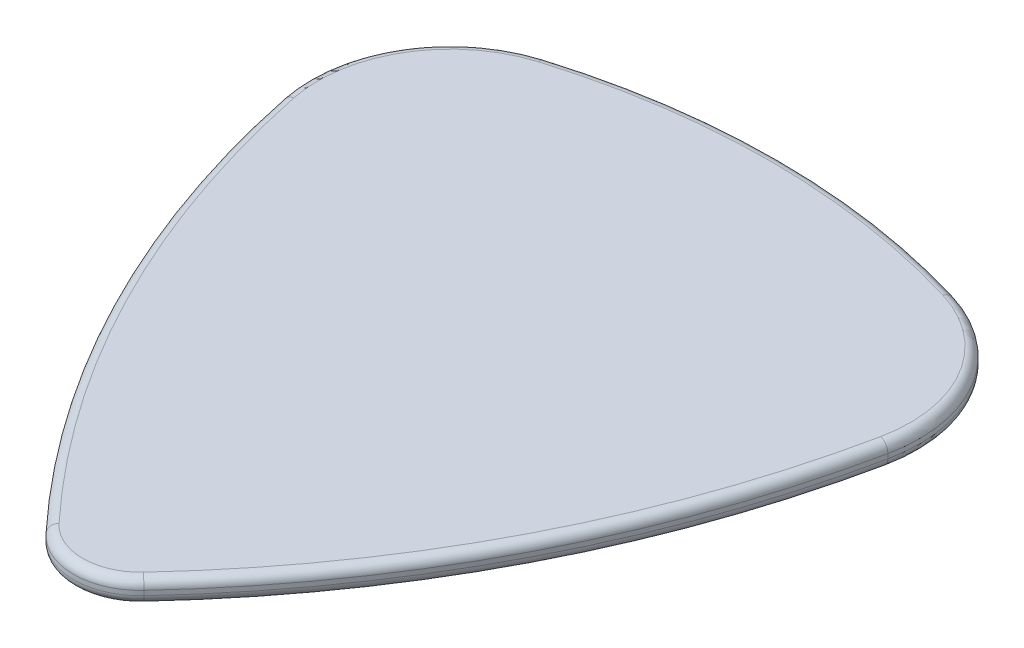
ISO-10303-21;
HEADER;
FILE_DESCRIPTION(('STEP AP214'),'2;1');
FILE_NAME('part.step','',(''),(''),'','','');
FILE_SCHEMA(('AUTOMOTIVE_DESIGN { 1 0 10303 214 1 1 1 1 }'));
ENDSEC;
DATA;
#1=APPLICATION_CONTEXT('core data for automotive mechanical design processes');
#2=APPLICATION_PROTOCOL_DEFINITION('international standard','automotive_design',2000,#1);
#3=PRODUCT_CONTEXT('',#1,'mechanical');
#4=PRODUCT('Part','Part','',(#3));
#5=PRODUCT_RELATED_PRODUCT_CATEGORY('part','',(#4));
#6=PRODUCT_DEFINITION_FORMATION('','',#4);
#7=PRODUCT_DEFINITION_CONTEXT('part definition',#1,'design');
#8=PRODUCT_DEFINITION('design','',#6,#7);
#9=PRODUCT_DEFINITION_SHAPE('','',#8);
#10=(LENGTH_UNIT() NAMED_UNIT(*) SI_UNIT(.MILLI.,.METRE.));
#11=(NAMED_UNIT(*) PLANE_ANGLE_UNIT() SI_UNIT($,.RADIAN.));
#12=(NAMED_UNIT(*) SI_UNIT($,.STERADIAN.) SOLID_ANGLE_UNIT());
#13=UNCERTAINTY_MEASURE_WITH_UNIT(LENGTH_MEASURE(1.E-05),#10,'distance_accuracy_value','');
#14=(GEOMETRIC_REPRESENTATION_CONTEXT(3) GLOBAL_UNCERTAINTY_ASSIGNED_CONTEXT((#13)) GLOBAL_UNIT_ASSIGNED_CONTEXT((#10,
#11,#12)) REPRESENTATION_CONTEXT('',''));
#15=CARTESIAN_POINT('',(0.,0.,0.));
#16=DIRECTION('',(0.,0.,1.));
#17=DIRECTION('',(1.,0.,0.));
#18=AXIS2_PLACEMENT_3D('',#15,#16,#17);
#19=CARTESIAN_POINT('',(-7.09730033956618,1.,-23.4285878338835));
#20=DIRECTION('',(0.,-1.,0.));
#21=DIRECTION('',(0.,0.,-1.));
#22=AXIS2_PLACEMENT_3D('',#19,#20,#21);
#23=CYLINDRICAL_SURFACE('',#22,6.14);
#24=DIRECTION('',(0.,-1.,0.));
#25=VECTOR('',#24,1.);
#26=CARTESIAN_POINT('',(-8.87742387244758,1.,-29.3048757954866));
#27=LINE('',#26,#25);
#28=CARTESIAN_POINT('',(-8.87742387244758,0.6,-29.3048757954866));
#29=VERTEX_POINT('',#28);
#30=CARTESIAN_POINT('',(-8.87742387244758,0.4,-29.3048757954866));
#31=VERTEX_POINT('',#30);
#32=EDGE_CURVE('E215',#29,#31,#27,.T.);
#33=ORIENTED_EDGE('',*,*,#32,.T.);
#34=CARTESIAN_POINT('',(-7.09730033956618,0.4,-23.4285878338835));
#35=DIRECTION('',(0.,-1.,0.));
#36=DIRECTION('',(0.,0.,-1.));
#37=AXIS2_PLACEMENT_3D('',#34,#35,#36);
#38=CIRCLE('',#37,6.14);
#39=CARTESIAN_POINT('',(-13.11,0.4,-22.1847860838369));
#40=VERTEX_POINT('',#39);
#41=EDGE_CURVE('E190',#31,#40,#38,.F.);
#42=ORIENTED_EDGE('',*,*,#41,.T.);
#43=DIRECTION('',(0.,-1.,0.));
#44=VECTOR('',#43,1.);
#45=CARTESIAN_POINT('',(-13.11,1.,-22.1847860838369));
#46=LINE('',#45,#44);
#47=CARTESIAN_POINT('',(-13.11,0.6,-22.1847860838369));
#48=VERTEX_POINT('',#47);
#49=EDGE_CURVE('E144',#48,#40,#46,.T.);
#50=ORIENTED_EDGE('',*,*,#49,.F.);
#51=CARTESIAN_POINT('',(-7.09730033956618,0.6,-23.4285878338835));
#52=DIRECTION('',(0.,-1.,0.));
#53=DIRECTION('',(0.,0.,-1.));
#54=AXIS2_PLACEMENT_3D('',#51,#52,#53);
#55=CIRCLE('',#54,6.14);
#56=EDGE_CURVE('E188',#48,#29,#55,.T.);
#57=ORIENTED_EDGE('',*,*,#56,.T.);
#58=EDGE_LOOP('',(#33,#42,#50,#57));
#59=FACE_BOUND('',#58,.T.);
#60=ADVANCED_FACE('F32',(#59),#23,.T.);
#61=CARTESIAN_POINT('',(30.3498714869794,1.,-31.17500133906));
#62=DIRECTION('',(0.,-1.,0.));
#63=DIRECTION('',(0.,0.,-1.));
#64=AXIS2_PLACEMENT_3D('',#61,#62,#63);
#65=CYLINDRICAL_SURFACE('',#64,44.3800000000001);
#66=ORIENTED_EDGE('',*,*,#49,.T.);
#67=CARTESIAN_POINT('',(30.3498714869794,0.4,-31.17500133906));
#68=DIRECTION('',(0.,-1.,0.));
#69=DIRECTION('',(0.,0.,-1.));
#70=AXIS2_PLACEMENT_3D('',#67,#68,#69);
#71=CIRCLE('',#70,44.3800000000001);
#72=CARTESIAN_POINT('',(-2.1218569747406,0.4,-0.92320386009465));
#73=VERTEX_POINT('',#72);
#74=EDGE_CURVE('E143',#40,#73,#71,.F.);
#75=ORIENTED_EDGE('',*,*,#74,.T.);
#76=DIRECTION('',(0.,-1.,0.));
#77=VECTOR('',#76,1.);
#78=CARTESIAN_POINT('',(-2.1218569747406,1.,-0.92320386009465));
#79=LINE('',#78,#77);
#80=CARTESIAN_POINT('',(-2.1218569747406,0.6,-0.92320386009465));
#81=VERTEX_POINT('',#80);
#82=EDGE_CURVE('E125',#81,#73,#79,.T.);
#83=ORIENTED_EDGE('',*,*,#82,.F.);
#84=CARTESIAN_POINT('',(30.3498714869794,0.6,-31.17500133906));
#85=DIRECTION('',(0.,-1.,0.));
#86=DIRECTION('',(0.,0.,-1.));
#87=AXIS2_PLACEMENT_3D('',#84,#85,#86);
#88=CIRCLE('',#87,44.3800000000001);
#89=EDGE_CURVE('E140',#81,#48,#88,.T.);
#90=ORIENTED_EDGE('',*,*,#89,.T.);
#91=EDGE_LOOP('',(#66,#75,#83,#90));
#92=FACE_BOUND('',#91,.T.);
#93=ADVANCED_FACE('F138',(#92),#65,.T.);
#94=CARTESIAN_POINT('',(0.,1.,-2.9));
#95=DIRECTION('',(0.,-1.,0.));
#96=DIRECTION('',(0.,0.,-1.));
#97=AXIS2_PLACEMENT_3D('',#94,#95,#96);
#98=CYLINDRICAL_SURFACE('',#97,2.9);
#99=ORIENTED_EDGE('',*,*,#82,.T.);
#100=CARTESIAN_POINT('',(0.,0.4,-2.9));
#101=DIRECTION('',(0.,-1.,0.));
#102=DIRECTION('',(0.,0.,-1.));
#103=AXIS2_PLACEMENT_3D('',#100,#101,#102);
#104=CIRCLE('',#103,2.9);
#105=CARTESIAN_POINT('',(2.12185697474061,0.4,-0.923203860094646));
#106=VERTEX_POINT('',#105);
#107=EDGE_CURVE('E132',#73,#106,#104,.F.);
#108=ORIENTED_EDGE('',*,*,#107,.T.);
#109=DIRECTION('',(0.,-1.,0.));
#110=VECTOR('',#109,1.);
#111=CARTESIAN_POINT('',(2.12185697474061,1.,-0.923203860094646));
#112=LINE('',#111,#110);
#113=CARTESIAN_POINT('',(2.12185697474061,0.6,-0.923203860094646));
#114=VERTEX_POINT('',#113);
#115=EDGE_CURVE('E127',#114,#106,#112,.T.);
#116=ORIENTED_EDGE('',*,*,#115,.F.);
#117=CARTESIAN_POINT('',(0.,0.6,-2.9));
#118=DIRECTION('',(0.,-1.,0.));
#119=DIRECTION('',(0.,0.,-1.));
#120=AXIS2_PLACEMENT_3D('',#117,#118,#119);
#121=CIRCLE('',#120,2.9);
#122=EDGE_CURVE('E122',#114,#81,#121,.T.);
#123=ORIENTED_EDGE('',*,*,#122,.T.);
#124=EDGE_LOOP('',(#99,#108,#116,#123));
#125=FACE_BOUND('',#124,.T.);
#126=ADVANCED_FACE('F124',(#125),#98,.T.);
#127=CARTESIAN_POINT('',(-30.3498714869793,1.,-31.17500133906));
#128=DIRECTION('',(0.,-1.,0.));
#129=DIRECTION('',(0.,0.,-1.));
#130=AXIS2_PLACEMENT_3D('',#127,#128,#129);
#131=CYLINDRICAL_SURFACE('',#130,44.38);
#132=ORIENTED_EDGE('',*,*,#115,.T.);
#133=CARTESIAN_POINT('',(-30.3498714869793,0.4,-31.17500133906));
#134=DIRECTION('',(0.,-1.,0.));
#135=DIRECTION('',(0.,0.,-1.));
#136=AXIS2_PLACEMENT_3D('',#133,#134,#135);
#137=CIRCLE('',#136,44.38);
#138=CARTESIAN_POINT('',(13.11,0.4,-22.1847860838369));
#139=VERTEX_POINT('',#138);
#140=EDGE_CURVE('E177',#106,#139,#137,.F.);
#141=ORIENTED_EDGE('',*,*,#140,.T.);
#142=DIRECTION('',(0.,-1.,0.));
#143=VECTOR('',#142,1.);
#144=CARTESIAN_POINT('',(13.11,1.,-22.1847860838369));
#145=LINE('',#144,#143);
#146=CARTESIAN_POINT('',(13.11,0.6,-22.1847860838369));
#147=VERTEX_POINT('',#146);
#148=EDGE_CURVE('E233',#147,#139,#145,.T.);
#149=ORIENTED_EDGE('',*,*,#148,.F.);
#150=CARTESIAN_POINT('',(-30.3498714869793,0.6,-31.17500133906));
#151=DIRECTION('',(0.,-1.,0.));
#152=DIRECTION('',(0.,0.,-1.));
#153=AXIS2_PLACEMENT_3D('',#150,#151,#152);
#154=CIRCLE('',#153,44.38);
#155=EDGE_CURVE('E175',#147,#114,#154,.T.);
#156=ORIENTED_EDGE('',*,*,#155,.T.);
#157=EDGE_LOOP('',(#132,#141,#149,#156));
#158=FACE_BOUND('',#157,.T.);
#159=ADVANCED_FACE('F230',(#158),#131,.T.);
#160=CARTESIAN_POINT('',(7.09730033956618,1.,-23.4285878338835));
#161=DIRECTION('',(0.,-1.,0.));
#162=DIRECTION('',(0.,0.,-1.));
#163=AXIS2_PLACEMENT_3D('',#160,#161,#162);
#164=CYLINDRICAL_SURFACE('',#163,6.14);
#165=ORIENTED_EDGE('',*,*,#148,.T.);
#166=CARTESIAN_POINT('',(7.09730033956618,0.4,-23.4285878338835));
#167=DIRECTION('',(0.,-1.,0.));
#168=DIRECTION('',(0.,0.,-1.));
#169=AXIS2_PLACEMENT_3D('',#166,#167,#168);
#170=CIRCLE('',#169,6.14);
#171=CARTESIAN_POINT('',(8.87742387244757,0.4,-29.3048757954866));
#172=VERTEX_POINT('',#171);
#173=EDGE_CURVE('E181',#139,#172,#170,.F.);
#174=ORIENTED_EDGE('',*,*,#173,.T.);
#175=DIRECTION('',(0.,-1.,0.));
#176=VECTOR('',#175,1.);
#177=CARTESIAN_POINT('',(8.87742387244757,1.,-29.3048757954866));
#178=LINE('',#177,#176);
#179=CARTESIAN_POINT('',(8.87742387244757,0.6,-29.3048757954866));
#180=VERTEX_POINT('',#179);
#181=EDGE_CURVE('E236',#180,#172,#178,.T.);
#182=ORIENTED_EDGE('',*,*,#181,.F.);
#183=CARTESIAN_POINT('',(7.09730033956618,0.6,-23.4285878338835));
#184=DIRECTION('',(0.,-1.,0.));
#185=DIRECTION('',(0.,0.,-1.));
#186=AXIS2_PLACEMENT_3D('',#183,#184,#185);
#187=CIRCLE('',#186,6.14);
#188=EDGE_CURVE('E179',#180,#147,#187,.T.);
#189=ORIENTED_EDGE('',*,*,#188,.T.);
#190=EDGE_LOOP('',(#165,#174,#182,#189));
#191=FACE_BOUND('',#190,.T.);
#192=ADVANCED_FACE('F275',(#191),#164,.T.);
#193=CARTESIAN_POINT('',(0.,1.,0.));
#194=DIRECTION('',(0.,-1.,0.));
#195=DIRECTION('',(0.,0.,-1.));
#196=AXIS2_PLACEMENT_3D('',#193,#194,#195);
#197=CYLINDRICAL_SURFACE('',#196,30.62);
#198=ORIENTED_EDGE('',*,*,#181,.T.);
#199=CARTESIAN_POINT('',(0.,0.4,0.));
#200=DIRECTION('',(0.,-1.,0.));
#201=DIRECTION('',(0.,0.,-1.));
#202=AXIS2_PLACEMENT_3D('',#199,#200,#201);
#203=CIRCLE('',#202,30.62);
#204=EDGE_CURVE('E186',#172,#31,#203,.F.);
#205=ORIENTED_EDGE('',*,*,#204,.T.);
#206=ORIENTED_EDGE('',*,*,#32,.F.);
#207=CARTESIAN_POINT('',(0.,0.6,0.));
#208=DIRECTION('',(0.,-1.,0.));
#209=DIRECTION('',(0.,0.,-1.));
#210=AXIS2_PLACEMENT_3D('',#207,#208,#209);
#211=CIRCLE('',#210,30.62);
#212=EDGE_CURVE('E183',#29,#180,#211,.T.);
#213=ORIENTED_EDGE('',*,*,#212,.T.);
#214=EDGE_LOOP('',(#198,#205,#206,#213));
#215=FACE_BOUND('',#214,.T.);
#216=ADVANCED_FACE('F276',(#215),#197,.T.);
#217=CARTESIAN_POINT('',(-3.54865016978309,1.,-11.7142939169418));
#218=DIRECTION('',(0.,-1.,0.));
#219=DIRECTION('',(0.,0.,-1.));
#220=AXIS2_PLACEMENT_3D('',#217,#218,#219);
#221=PLANE('',#220);
#222=CARTESIAN_POINT('',(7.09730033956618,1.,-23.4285878338835));
#223=DIRECTION('',(0.,-1.,0.));
#224=DIRECTION('',(0.,0.,-1.));
#225=AXIS2_PLACEMENT_3D('',#222,#223,#224);
#226=CIRCLE('',#225,5.74);
#227=CARTESIAN_POINT('',(12.7182931817307,1.,-22.2658155138073));
#228=VERTEX_POINT('',#227);
#229=CARTESIAN_POINT('',(8.76145491265074,1.,-28.9220557328415));
#230=VERTEX_POINT('',#229);
#231=EDGE_CURVE('E41',#228,#230,#226,.F.);
#232=ORIENTED_EDGE('',*,*,#231,.T.);
#233=CARTESIAN_POINT('',(0.,1.,0.));
#234=DIRECTION('',(0.,-1.,0.));
#235=DIRECTION('',(0.,0.,-1.));
#236=AXIS2_PLACEMENT_3D('',#233,#234,#235);
#237=CIRCLE('',#236,30.22);
#238=CARTESIAN_POINT('',(-8.76145491265075,1.,-28.9220557328415));
#239=VERTEX_POINT('',#238);
#240=EDGE_CURVE('E11',#230,#239,#237,.F.);
#241=ORIENTED_EDGE('',*,*,#240,.T.);
#242=CARTESIAN_POINT('',(-7.09730033956618,1.,-23.4285878338835));
#243=DIRECTION('',(0.,-1.,0.));
#244=DIRECTION('',(0.,0.,-1.));
#245=AXIS2_PLACEMENT_3D('',#242,#243,#244);
#246=CIRCLE('',#245,5.73999999999999);
#247=CARTESIAN_POINT('',(-12.7182931817307,1.,-22.2658155138073));
#248=VERTEX_POINT('',#247);
#249=EDGE_CURVE('E192',#239,#248,#246,.F.);
#250=ORIENTED_EDGE('',*,*,#249,.T.);
#251=CARTESIAN_POINT('',(30.3498714869794,1.,-31.17500133906));
#252=DIRECTION('',(0.,-1.,0.));
#253=DIRECTION('',(0.,0.,-1.));
#254=AXIS2_PLACEMENT_3D('',#251,#252,#253);
#255=CIRCLE('',#254,43.9800000000001);
#256=CARTESIAN_POINT('',(-1.82918704719017,1.,-1.19586539663332));
#257=VERTEX_POINT('',#256);
#258=EDGE_CURVE('E194',#248,#257,#255,.F.);
#259=ORIENTED_EDGE('',*,*,#258,.T.);
#260=CARTESIAN_POINT('',(0.,1.,-2.9));
#261=DIRECTION('',(0.,-1.,0.));
#262=DIRECTION('',(0.,0.,-1.));
#263=AXIS2_PLACEMENT_3D('',#260,#261,#262);
#264=CIRCLE('',#263,2.5);
#265=CARTESIAN_POINT('',(1.82918704719017,1.,-1.19586539663332));
#266=VERTEX_POINT('',#265);
#267=EDGE_CURVE('E149',#257,#266,#264,.F.);
#268=ORIENTED_EDGE('',*,*,#267,.T.);
#269=CARTESIAN_POINT('',(-30.3498714869793,1.,-31.17500133906));
#270=DIRECTION('',(0.,-1.,0.));
#271=DIRECTION('',(0.,0.,-1.));
#272=AXIS2_PLACEMENT_3D('',#269,#270,#271);
#273=CIRCLE('',#272,43.98);
#274=EDGE_CURVE('E52',#266,#228,#273,.F.);
#275=ORIENTED_EDGE('',*,*,#274,.T.);
#276=EDGE_LOOP('',(#232,#241,#250,#259,#268,#275));
#277=FACE_BOUND('',#276,.T.);
#278=ADVANCED_FACE('F284',(#277),#221,.F.);
#279=CARTESIAN_POINT('',(-3.54865016978309,0.,-11.7142939169418));
#280=DIRECTION('',(0.,-1.,0.));
#281=DIRECTION('',(0.,0.,-1.));
#282=AXIS2_PLACEMENT_3D('',#279,#280,#281);
#283=PLANE('',#282);
#284=CARTESIAN_POINT('',(0.,0.,-2.9));
#285=DIRECTION('',(0.,-1.,0.));
#286=DIRECTION('',(0.,0.,-1.));
#287=AXIS2_PLACEMENT_3D('',#284,#285,#286);
#288=CIRCLE('',#287,2.5);
#289=CARTESIAN_POINT('',(1.82918704719018,0.,-1.19586539663331));
#290=VERTEX_POINT('',#289);
#291=CARTESIAN_POINT('',(-1.82918704719017,0.,-1.19586539663332));
#292=VERTEX_POINT('',#291);
#293=EDGE_CURVE('E170',#290,#292,#288,.T.);
#294=ORIENTED_EDGE('',*,*,#293,.T.);
#295=CARTESIAN_POINT('',(30.3498714869794,0.,-31.17500133906));
#296=DIRECTION('',(0.,-1.,0.));
#297=DIRECTION('',(0.,0.,-1.));
#298=AXIS2_PLACEMENT_3D('',#295,#296,#297);
#299=CIRCLE('',#298,43.9800000000001);
#300=CARTESIAN_POINT('',(-12.7182931817307,0.,-22.2658155138073));
#301=VERTEX_POINT('',#300);
#302=EDGE_CURVE('E133',#292,#301,#299,.T.);
#303=ORIENTED_EDGE('',*,*,#302,.T.);
#304=CARTESIAN_POINT('',(-7.09730033956618,0.,-23.4285878338835));
#305=DIRECTION('',(0.,-1.,0.));
#306=DIRECTION('',(0.,0.,-1.));
#307=AXIS2_PLACEMENT_3D('',#304,#305,#306);
#308=CIRCLE('',#307,5.73999999999999);
#309=CARTESIAN_POINT('',(-8.76145491265075,0.,-28.9220557328415));
#310=VERTEX_POINT('',#309);
#311=EDGE_CURVE('E159',#301,#310,#308,.T.);
#312=ORIENTED_EDGE('',*,*,#311,.T.);
#313=CARTESIAN_POINT('',(0.,0.,0.));
#314=DIRECTION('',(0.,-1.,0.));
#315=DIRECTION('',(0.,0.,-1.));
#316=AXIS2_PLACEMENT_3D('',#313,#314,#315);
#317=CIRCLE('',#316,30.22);
#318=CARTESIAN_POINT('',(8.76145491265074,0.,-28.9220557328415));
#319=VERTEX_POINT('',#318);
#320=EDGE_CURVE('E164',#310,#319,#317,.T.);
#321=ORIENTED_EDGE('',*,*,#320,.T.);
#322=CARTESIAN_POINT('',(7.09730033956618,0.,-23.4285878338835));
#323=DIRECTION('',(0.,-1.,0.));
#324=DIRECTION('',(0.,0.,-1.));
#325=AXIS2_PLACEMENT_3D('',#322,#323,#324);
#326=CIRCLE('',#325,5.74);
#327=CARTESIAN_POINT('',(12.7182931817307,0.,-22.2658155138073));
#328=VERTEX_POINT('',#327);
#329=EDGE_CURVE('E166',#319,#328,#326,.T.);
#330=ORIENTED_EDGE('',*,*,#329,.T.);
#331=CARTESIAN_POINT('',(-30.3498714869793,0.,-31.17500133906));
#332=DIRECTION('',(0.,-1.,0.));
#333=DIRECTION('',(0.,0.,-1.));
#334=AXIS2_PLACEMENT_3D('',#331,#332,#333);
#335=CIRCLE('',#334,43.98);
#336=EDGE_CURVE('E168',#328,#290,#335,.T.);
#337=ORIENTED_EDGE('',*,*,#336,.T.);
#338=EDGE_LOOP('',(#294,#303,#312,#321,#330,#337));
#339=FACE_BOUND('',#338,.T.);
#340=ADVANCED_FACE('F286',(#339),#283,.T.);
#341=CARTESIAN_POINT('',(7.09730033956618,0.4,-23.4285878338835));
#342=DIRECTION('',(0.,-1.,0.));
#343=DIRECTION('',(0.,0.,-1.));
#344=AXIS2_PLACEMENT_3D('',#341,#342,#343);
#345=TOROIDAL_SURFACE('',#344,5.74,0.4);
#346=CARTESIAN_POINT('',(12.7182931817307,0.4,-22.2658155138073));
#347=DIRECTION('',(-0.202573574926172,0.,0.979267045673258));
#348=DIRECTION('',(0.979267045673258,0.,0.202573574926172));
#349=AXIS2_PLACEMENT_3D('',#346,#347,#348);
#350=CIRCLE('',#349,0.4);
#351=EDGE_CURVE('E209',#328,#139,#350,.T.);
#352=ORIENTED_EDGE('',*,*,#351,.F.);
#353=ORIENTED_EDGE('',*,*,#329,.F.);
#354=CARTESIAN_POINT('',(8.76145491265074,0.4,-28.9220557328415));
#355=DIRECTION('',(-0.957050156612888,0.,-0.289922399492083));
#356=DIRECTION('',(-0.289922399492083,0.,0.957050156612888));
#357=AXIS2_PLACEMENT_3D('',#354,#355,#356);
#358=CIRCLE('',#357,0.4);
#359=EDGE_CURVE('E212',#172,#319,#358,.T.);
#360=ORIENTED_EDGE('',*,*,#359,.F.);
#361=ORIENTED_EDGE('',*,*,#173,.F.);
#362=EDGE_LOOP('',(#352,#353,#360,#361));
#363=FACE_BOUND('',#362,.T.);
#364=ADVANCED_FACE('F272',(#363),#345,.T.);
#365=CARTESIAN_POINT('',(0.,0.4,0.));
#366=DIRECTION('',(0.,-1.,0.));
#367=DIRECTION('',(0.,0.,-1.));
#368=AXIS2_PLACEMENT_3D('',#365,#366,#367);
#369=TOROIDAL_SURFACE('',#368,30.22,0.4);
#370=ORIENTED_EDGE('',*,*,#359,.T.);
#371=ORIENTED_EDGE('',*,*,#320,.F.);
#372=CARTESIAN_POINT('',(-8.76145491265075,0.4,-28.9220557328415));
#373=DIRECTION('',(-0.957050156612888,0.,0.289922399492083));
#374=DIRECTION('',(0.289922399492083,0.,0.957050156612888));
#375=AXIS2_PLACEMENT_3D('',#372,#373,#374);
#376=CIRCLE('',#375,0.4);
#377=EDGE_CURVE('E206',#31,#310,#376,.T.);
#378=ORIENTED_EDGE('',*,*,#377,.F.);
#379=ORIENTED_EDGE('',*,*,#204,.F.);
#380=EDGE_LOOP('',(#370,#371,#378,#379));
#381=FACE_BOUND('',#380,.T.);
#382=ADVANCED_FACE('F252',(#381),#369,.T.);
#383=CARTESIAN_POINT('',(-30.3498714869793,0.4,-31.17500133906));
#384=DIRECTION('',(0.,-1.,0.));
#385=DIRECTION('',(0.,0.,-1.));
#386=AXIS2_PLACEMENT_3D('',#383,#384,#385);
#387=TOROIDAL_SURFACE('',#386,43.98,0.4);
#388=ORIENTED_EDGE('',*,*,#351,.T.);
#389=ORIENTED_EDGE('',*,*,#140,.F.);
#390=CARTESIAN_POINT('',(1.82918704719018,0.4,-1.19586539663331));
#391=DIRECTION('',(-0.681653841346671,0.,0.731674818876068));
#392=DIRECTION('',(0.731674818876069,0.,0.681653841346671));
#393=AXIS2_PLACEMENT_3D('',#390,#391,#392);
#394=CIRCLE('',#393,0.4);
#395=EDGE_CURVE('E203',#290,#106,#394,.T.);
#396=ORIENTED_EDGE('',*,*,#395,.F.);
#397=ORIENTED_EDGE('',*,*,#336,.F.);
#398=EDGE_LOOP('',(#388,#389,#396,#397));
#399=FACE_BOUND('',#398,.T.);
#400=ADVANCED_FACE('F268',(#399),#387,.T.);
#401=CARTESIAN_POINT('',(-7.09730033956618,0.4,-23.4285878338835));
#402=DIRECTION('',(0.,-1.,0.));
#403=DIRECTION('',(0.,0.,-1.));
#404=AXIS2_PLACEMENT_3D('',#401,#402,#403);
#405=TOROIDAL_SURFACE('',#404,5.73999999999999,0.4);
#406=ORIENTED_EDGE('',*,*,#377,.T.);
#407=ORIENTED_EDGE('',*,*,#311,.F.);
#408=CARTESIAN_POINT('',(-12.7182931817307,0.4,-22.2658155138073));
#409=DIRECTION('',(0.202573574926164,0.,0.97926704567326));
#410=DIRECTION('',(0.97926704567326,0.,-0.202573574926164));
#411=AXIS2_PLACEMENT_3D('',#408,#409,#410);
#412=CIRCLE('',#411,0.4);
#413=EDGE_CURVE('E201',#40,#301,#412,.T.);
#414=ORIENTED_EDGE('',*,*,#413,.F.);
#415=ORIENTED_EDGE('',*,*,#41,.F.);
#416=EDGE_LOOP('',(#406,#407,#414,#415));
#417=FACE_BOUND('',#416,.T.);
#418=ADVANCED_FACE('F256',(#417),#405,.T.);
#419=CARTESIAN_POINT('',(0.,0.4,-2.9));
#420=DIRECTION('',(0.,-1.,0.));
#421=DIRECTION('',(0.,0.,-1.));
#422=AXIS2_PLACEMENT_3D('',#419,#420,#421);
#423=TOROIDAL_SURFACE('',#422,2.5,0.4);
#424=ORIENTED_EDGE('',*,*,#395,.T.);
#425=ORIENTED_EDGE('',*,*,#107,.F.);
#426=CARTESIAN_POINT('',(-1.82918704719017,0.4,-1.19586539663332));
#427=DIRECTION('',(-0.681653841346672,0.,-0.731674818876068));
#428=DIRECTION('',(-0.731674818876068,0.,0.681653841346672));
#429=AXIS2_PLACEMENT_3D('',#426,#427,#428);
#430=CIRCLE('',#429,0.4);
#431=EDGE_CURVE('E199',#292,#73,#430,.T.);
#432=ORIENTED_EDGE('',*,*,#431,.F.);
#433=ORIENTED_EDGE('',*,*,#293,.F.);
#434=EDGE_LOOP('',(#424,#425,#432,#433));
#435=FACE_BOUND('',#434,.T.);
#436=ADVANCED_FACE('F264',(#435),#423,.T.);
#437=CARTESIAN_POINT('',(30.3498714869794,0.4,-31.17500133906));
#438=DIRECTION('',(0.,-1.,0.));
#439=DIRECTION('',(0.,0.,-1.));
#440=AXIS2_PLACEMENT_3D('',#437,#438,#439);
#441=TOROIDAL_SURFACE('',#440,43.9800000000001,0.4);
#442=ORIENTED_EDGE('',*,*,#413,.T.);
#443=ORIENTED_EDGE('',*,*,#302,.F.);
#444=ORIENTED_EDGE('',*,*,#431,.T.);
#445=ORIENTED_EDGE('',*,*,#74,.F.);
#446=EDGE_LOOP('',(#442,#443,#444,#445));
#447=FACE_BOUND('',#446,.T.);
#448=ADVANCED_FACE('F259',(#447),#441,.T.);
#449=CARTESIAN_POINT('',(0.,0.6,-2.9));
#450=DIRECTION('',(0.,-1.,0.));
#451=DIRECTION('',(0.,0.,-1.));
#452=AXIS2_PLACEMENT_3D('',#449,#450,#451);
#453=TOROIDAL_SURFACE('',#452,2.5,0.4);
#454=CARTESIAN_POINT('',(-1.82918704719017,0.6,-1.19586539663332));
#455=DIRECTION('',(-0.681653841346671,0.,-0.731674818876068));
#456=DIRECTION('',(-0.731674818876068,0.,0.681653841346671));
#457=AXIS2_PLACEMENT_3D('',#454,#455,#456);
#458=CIRCLE('',#457,0.4);
#459=EDGE_CURVE('E148',#81,#257,#458,.T.);
#460=ORIENTED_EDGE('',*,*,#459,.F.);
#461=ORIENTED_EDGE('',*,*,#122,.F.);
#462=CARTESIAN_POINT('',(1.82918704719017,0.6,-1.19586539663332));
#463=DIRECTION('',(0.681653841346672,0.,-0.731674818876067));
#464=DIRECTION('',(-0.731674818876068,0.,-0.681653841346672));
#465=AXIS2_PLACEMENT_3D('',#462,#463,#464);
#466=CIRCLE('',#465,0.4);
#467=EDGE_CURVE('E36',#266,#114,#466,.T.);
#468=ORIENTED_EDGE('',*,*,#467,.F.);
#469=ORIENTED_EDGE('',*,*,#267,.F.);
#470=EDGE_LOOP('',(#460,#461,#468,#469));
#471=FACE_BOUND('',#470,.T.);
#472=ADVANCED_FACE('F34',(#471),#453,.T.);
#473=CARTESIAN_POINT('',(-30.3498714869793,0.6,-31.17500133906));
#474=DIRECTION('',(0.,-1.,0.));
#475=DIRECTION('',(0.,0.,-1.));
#476=AXIS2_PLACEMENT_3D('',#473,#474,#475);
#477=TOROIDAL_SURFACE('',#476,43.98,0.4);
#478=ORIENTED_EDGE('',*,*,#467,.T.);
#479=ORIENTED_EDGE('',*,*,#155,.F.);
#480=CARTESIAN_POINT('',(12.7182931817307,0.6,-22.2658155138073));
#481=DIRECTION('',(0.202573574926159,0.,-0.979267045673261));
#482=DIRECTION('',(-0.979267045673261,0.,-0.202573574926159));
#483=AXIS2_PLACEMENT_3D('',#480,#481,#482);
#484=CIRCLE('',#483,0.4);
#485=EDGE_CURVE('E152',#228,#147,#484,.T.);
#486=ORIENTED_EDGE('',*,*,#485,.F.);
#487=ORIENTED_EDGE('',*,*,#274,.F.);
#488=EDGE_LOOP('',(#478,#479,#486,#487));
#489=FACE_BOUND('',#488,.T.);
#490=ADVANCED_FACE('F227',(#489),#477,.T.);
#491=CARTESIAN_POINT('',(30.3498714869794,0.6,-31.17500133906));
#492=DIRECTION('',(0.,-1.,0.));
#493=DIRECTION('',(0.,0.,-1.));
#494=AXIS2_PLACEMENT_3D('',#491,#492,#493);
#495=TOROIDAL_SURFACE('',#494,43.9800000000001,0.4);
#496=ORIENTED_EDGE('',*,*,#459,.T.);
#497=ORIENTED_EDGE('',*,*,#258,.F.);
#498=CARTESIAN_POINT('',(-12.7182931817307,0.6,-22.2658155138073));
#499=DIRECTION('',(-0.202573574926164,0.,-0.97926704567326));
#500=DIRECTION('',(-0.97926704567326,0.,0.202573574926164));
#501=AXIS2_PLACEMENT_3D('',#498,#499,#500);
#502=CIRCLE('',#501,0.4);
#503=EDGE_CURVE('E156',#48,#248,#502,.T.);
#504=ORIENTED_EDGE('',*,*,#503,.F.);
#505=ORIENTED_EDGE('',*,*,#89,.F.);
#506=EDGE_LOOP('',(#496,#497,#504,#505));
#507=FACE_BOUND('',#506,.T.);
#508=ADVANCED_FACE('F154',(#507),#495,.T.);
#509=CARTESIAN_POINT('',(7.09730033956618,0.6,-23.4285878338835));
#510=DIRECTION('',(0.,-1.,0.));
#511=DIRECTION('',(0.,0.,-1.));
#512=AXIS2_PLACEMENT_3D('',#509,#510,#511);
#513=TOROIDAL_SURFACE('',#512,5.74,0.4);
#514=ORIENTED_EDGE('',*,*,#485,.T.);
#515=ORIENTED_EDGE('',*,*,#188,.F.);
#516=CARTESIAN_POINT('',(8.76145491265074,0.6,-28.9220557328415));
#517=DIRECTION('',(-0.957050156612888,0.,-0.289922399492083));
#518=DIRECTION('',(-0.289922399492083,0.,0.957050156612888));
#519=AXIS2_PLACEMENT_3D('',#516,#517,#518);
#520=CIRCLE('',#519,0.4);
#521=EDGE_CURVE('E218',#230,#180,#520,.T.);
#522=ORIENTED_EDGE('',*,*,#521,.F.);
#523=ORIENTED_EDGE('',*,*,#231,.F.);
#524=EDGE_LOOP('',(#514,#515,#522,#523));
#525=FACE_BOUND('',#524,.T.);
#526=ADVANCED_FACE('F224',(#525),#513,.T.);
#527=CARTESIAN_POINT('',(-7.09730033956618,0.6,-23.4285878338835));
#528=DIRECTION('',(0.,-1.,0.));
#529=DIRECTION('',(0.,0.,-1.));
#530=AXIS2_PLACEMENT_3D('',#527,#528,#529);
#531=TOROIDAL_SURFACE('',#530,5.73999999999999,0.4);
#532=ORIENTED_EDGE('',*,*,#503,.T.);
#533=ORIENTED_EDGE('',*,*,#249,.F.);
#534=CARTESIAN_POINT('',(-8.76145491265075,0.6,-28.9220557328415));
#535=DIRECTION('',(0.957050156612888,0.,-0.289922399492083));
#536=DIRECTION('',(-0.289922399492083,0.,-0.957050156612888));
#537=AXIS2_PLACEMENT_3D('',#534,#535,#536);
#538=CIRCLE('',#537,0.4);
#539=EDGE_CURVE('E216',#29,#239,#538,.T.);
#540=ORIENTED_EDGE('',*,*,#539,.F.);
#541=ORIENTED_EDGE('',*,*,#56,.F.);
#542=EDGE_LOOP('',(#532,#533,#540,#541));
#543=FACE_BOUND('',#542,.T.);
#544=ADVANCED_FACE('F283',(#543),#531,.T.);
#545=CARTESIAN_POINT('',(0.,0.6,0.));
#546=DIRECTION('',(0.,-1.,0.));
#547=DIRECTION('',(0.,0.,-1.));
#548=AXIS2_PLACEMENT_3D('',#545,#546,#547);
#549=TOROIDAL_SURFACE('',#548,30.22,0.4);
#550=ORIENTED_EDGE('',*,*,#521,.T.);
#551=ORIENTED_EDGE('',*,*,#212,.F.);
#552=ORIENTED_EDGE('',*,*,#539,.T.);
#553=ORIENTED_EDGE('',*,*,#240,.F.);
#554=EDGE_LOOP('',(#550,#551,#552,#553));
#555=FACE_BOUND('',#554,.T.);
#556=ADVANCED_FACE('F279',(#555),#549,.T.);
#557=CLOSED_SHELL('',(#60,#93,#126,#159,#192,#216,#278,#340,#364,#382,#400,#418,#436,#448,#472,
#490,#508,#526,#544,#556));
#558=MANIFOLD_SOLID_BREP('B2',#557);
#559=ADVANCED_BREP_SHAPE_REPRESENTATION('',(#18,#558),#14);
#560=SHAPE_DEFINITION_REPRESENTATION(#9,#559);
ENDSEC;
END-ISO-10303-21;
